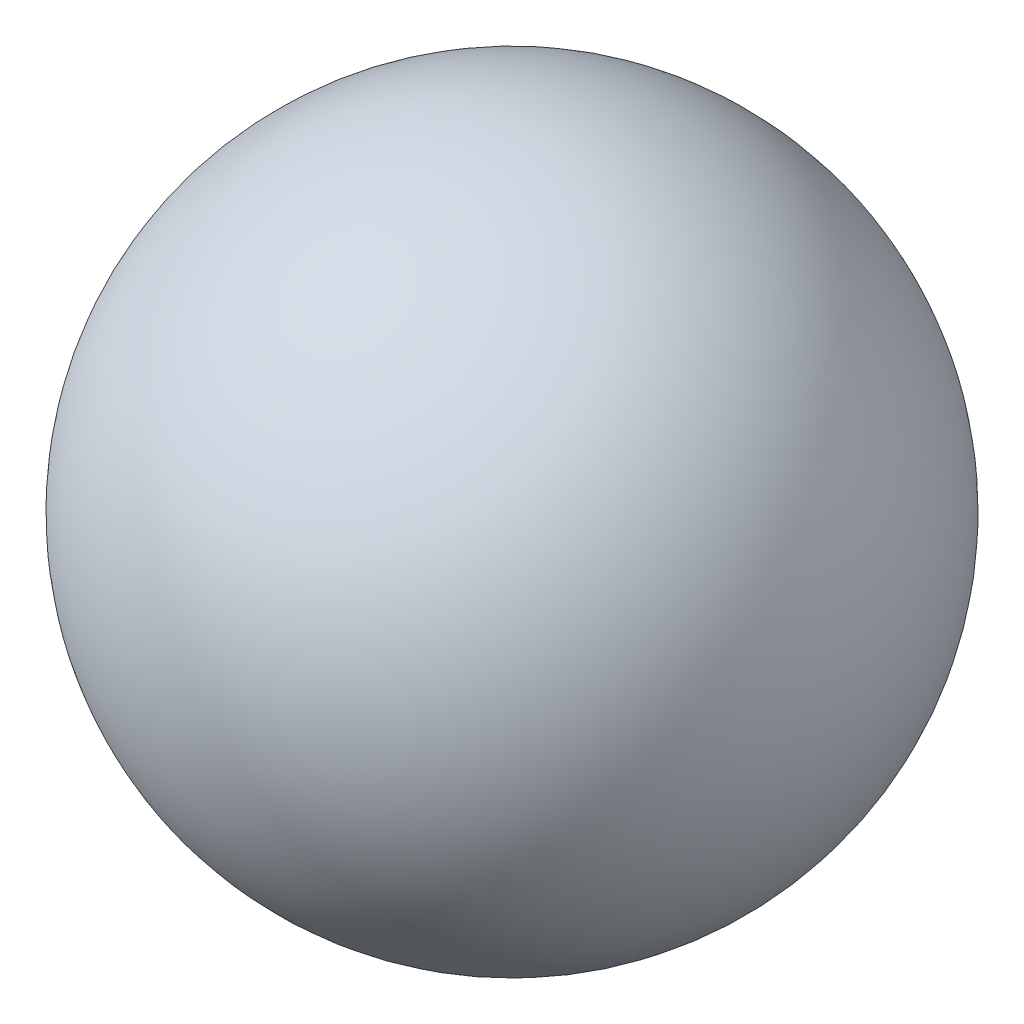
ISO-10303-21;
HEADER;
FILE_DESCRIPTION(('STEP AP214'),'2;1');
FILE_NAME('part.step','',(''),(''),'','','');
FILE_SCHEMA(('AUTOMOTIVE_DESIGN { 1 0 10303 214 1 1 1 1 }'));
ENDSEC;
DATA;
#1=APPLICATION_CONTEXT('core data for automotive mechanical design processes');
#2=APPLICATION_PROTOCOL_DEFINITION('international standard','automotive_design',2000,#1);
#3=PRODUCT_CONTEXT('',#1,'mechanical');
#4=PRODUCT('Part','Part','',(#3));
#5=PRODUCT_RELATED_PRODUCT_CATEGORY('part','',(#4));
#6=PRODUCT_DEFINITION_FORMATION('','',#4);
#7=PRODUCT_DEFINITION_CONTEXT('part definition',#1,'design');
#8=PRODUCT_DEFINITION('design','',#6,#7);
#9=PRODUCT_DEFINITION_SHAPE('','',#8);
#10=(LENGTH_UNIT() NAMED_UNIT(*) SI_UNIT(.MILLI.,.METRE.));
#11=(NAMED_UNIT(*) PLANE_ANGLE_UNIT() SI_UNIT($,.RADIAN.));
#12=(NAMED_UNIT(*) SI_UNIT($,.STERADIAN.) SOLID_ANGLE_UNIT());
#13=UNCERTAINTY_MEASURE_WITH_UNIT(LENGTH_MEASURE(1.E-05),#10,'distance_accuracy_value','');
#14=(GEOMETRIC_REPRESENTATION_CONTEXT(3) GLOBAL_UNCERTAINTY_ASSIGNED_CONTEXT((#13)) GLOBAL_UNIT_ASSIGNED_CONTEXT((#10,
#11,#12)) REPRESENTATION_CONTEXT('',''));
#15=CARTESIAN_POINT('',(0.,0.,0.));
#16=DIRECTION('',(0.,0.,1.));
#17=DIRECTION('',(1.,0.,0.));
#18=AXIS2_PLACEMENT_3D('',#15,#16,#17);
#19=CARTESIAN_POINT('',(-11.7366912354003,-2.,0.559087510928976));
#20=DIRECTION('',(0.,0.,1.));
#21=DIRECTION('',(1.,0.,0.));
#22=AXIS2_PLACEMENT_3D('',#19,#20,#21);
#23=SPHERICAL_SURFACE('',#22,1.05);
#24=CARTESIAN_POINT('',(-11.7366912354003,-2.,1.60908751092898));
#25=VERTEX_POINT('',#24);
#26=VERTEX_LOOP('',#25);
#27=FACE_BOUND('',#26,.T.);
#28=ADVANCED_FACE('F12',(#27),#23,.T.);
#29=CLOSED_SHELL('',(#28));
#30=MANIFOLD_SOLID_BREP('B1',#29);
#31=ADVANCED_BREP_SHAPE_REPRESENTATION('',(#18,#30),#14);
#32=SHAPE_DEFINITION_REPRESENTATION(#9,#31);
ENDSEC;
END-ISO-10303-21;
